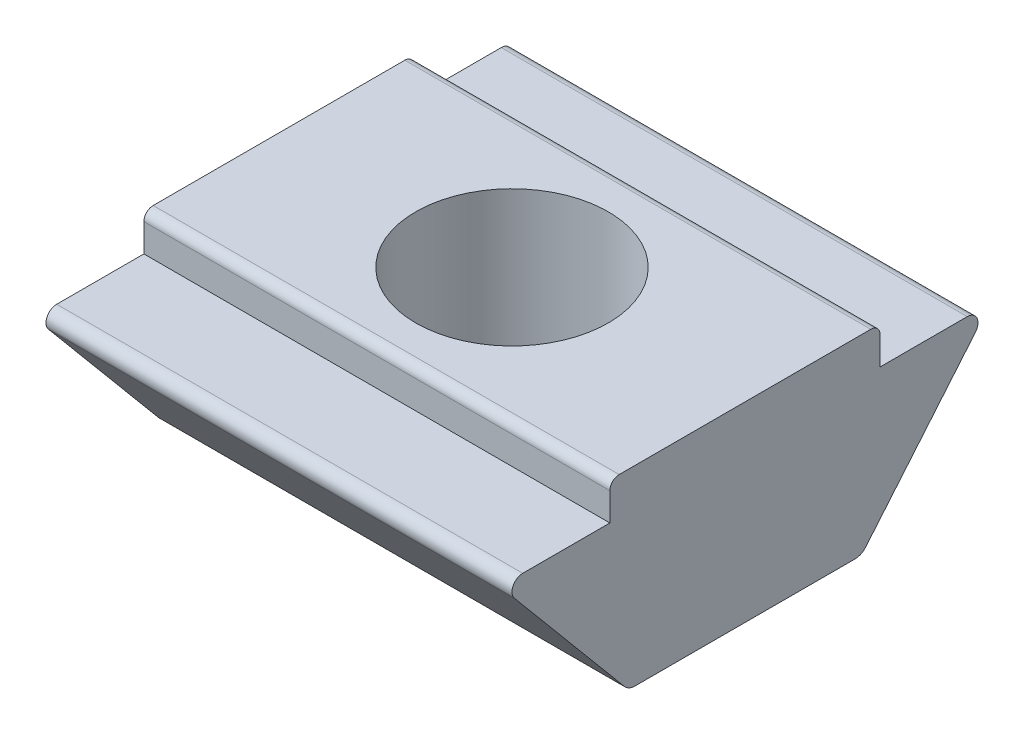
ISO-10303-21;
HEADER;
FILE_DESCRIPTION(('STEP AP214'),'2;1');
FILE_NAME('part.step','',(''),(''),'','','');
FILE_SCHEMA(('AUTOMOTIVE_DESIGN { 1 0 10303 214 1 1 1 1 }'));
ENDSEC;
DATA;
#1=APPLICATION_CONTEXT('core data for automotive mechanical design processes');
#2=APPLICATION_PROTOCOL_DEFINITION('international standard','automotive_design',2000,#1);
#3=PRODUCT_CONTEXT('',#1,'mechanical');
#4=PRODUCT('Part','Part','',(#3));
#5=PRODUCT_RELATED_PRODUCT_CATEGORY('part','',(#4));
#6=PRODUCT_DEFINITION_FORMATION('','',#4);
#7=PRODUCT_DEFINITION_CONTEXT('part definition',#1,'design');
#8=PRODUCT_DEFINITION('design','',#6,#7);
#9=PRODUCT_DEFINITION_SHAPE('','',#8);
#10=(LENGTH_UNIT() NAMED_UNIT(*) SI_UNIT(.MILLI.,.METRE.));
#11=(NAMED_UNIT(*) PLANE_ANGLE_UNIT() SI_UNIT($,.RADIAN.));
#12=(NAMED_UNIT(*) SI_UNIT($,.STERADIAN.) SOLID_ANGLE_UNIT());
#13=UNCERTAINTY_MEASURE_WITH_UNIT(LENGTH_MEASURE(1.E-05),#10,'distance_accuracy_value','');
#14=(GEOMETRIC_REPRESENTATION_CONTEXT(3) GLOBAL_UNCERTAINTY_ASSIGNED_CONTEXT((#13)) GLOBAL_UNIT_ASSIGNED_CONTEXT((#10,
#11,#12)) REPRESENTATION_CONTEXT('',''));
#15=CARTESIAN_POINT('',(0.,0.,0.));
#16=DIRECTION('',(0.,0.,1.));
#17=DIRECTION('',(1.,0.,0.));
#18=AXIS2_PLACEMENT_3D('',#15,#16,#17);
#19=CARTESIAN_POINT('',(5.,-1.17763591617242,-4.94636223024199));
#20=DIRECTION('',(0.,0.641895287706171,0.766792305399977));
#21=DIRECTION('',(0.,-0.766792305399977,0.641895287706171));
#22=AXIS2_PLACEMENT_3D('',#19,#20,#21);
#23=PLANE('',#22);
#24=DIRECTION('',(0.,0.766792305399977,-0.641895287706171));
#25=VECTOR('',#24,1.);
#26=CARTESIAN_POINT('',(5.,-1.17763591617242,-4.94636223024199));
#27=LINE('',#26,#25);
#28=CARTESIAN_POINT('',(5.,-3.99256858631185,-2.58993272064991));
#29=VERTEX_POINT('',#28);
#30=CARTESIAN_POINT('',(5.,-1.17763591617242,-4.94636223024199));
#31=VERTEX_POINT('',#30);
#32=EDGE_CURVE('E140',#29,#31,#27,.T.);
#33=ORIENTED_EDGE('',*,*,#32,.F.);
#34=DIRECTION('',(-1.,0.,0.));
#35=VECTOR('',#34,1.);
#36=CARTESIAN_POINT('',(5.,-3.99256858631185,-2.58993272064991));
#37=LINE('',#36,#35);
#38=CARTESIAN_POINT('',(-5.,-3.99256858631185,-2.58993272064991));
#39=VERTEX_POINT('',#38);
#40=EDGE_CURVE('E185',#29,#39,#37,.T.);
#41=ORIENTED_EDGE('',*,*,#40,.T.);
#42=DIRECTION('',(0.,0.766792305399977,-0.641895287706171));
#43=VECTOR('',#42,1.);
#44=CARTESIAN_POINT('',(-5.,-1.17763591617242,-4.94636223024199));
#45=LINE('',#44,#43);
#46=CARTESIAN_POINT('',(-5.,-1.17763591617242,-4.94636223024199));
#47=VERTEX_POINT('',#46);
#48=EDGE_CURVE('E164',#39,#47,#45,.T.);
#49=ORIENTED_EDGE('',*,*,#48,.T.);
#50=DIRECTION('',(-1.,0.,0.));
#51=VECTOR('',#50,1.);
#52=CARTESIAN_POINT('',(5.,-1.17763591617242,-4.94636223024199));
#53=LINE('',#52,#51);
#54=EDGE_CURVE('E157',#31,#47,#53,.T.);
#55=ORIENTED_EDGE('',*,*,#54,.F.);
#56=EDGE_LOOP('',(#33,#41,#49,#55));
#57=FACE_BOUND('',#56,.T.);
#58=ADVANCED_FACE('F38',(#57),#23,.F.);
#59=CARTESIAN_POINT('',(5.,-1.03,-4.77));
#60=DIRECTION('',(-1.,0.,0.));
#61=DIRECTION('',(0.,0.,1.));
#62=AXIS2_PLACEMENT_3D('',#59,#60,#61);
#63=CYLINDRICAL_SURFACE('',#62,0.229999999999998);
#64=CARTESIAN_POINT('',(-5.,-1.03,-4.77));
#65=DIRECTION('',(1.,0.,0.));
#66=DIRECTION('',(0.,0.,1.));
#67=AXIS2_PLACEMENT_3D('',#64,#65,#66);
#68=CIRCLE('',#67,0.229999999999998);
#69=CARTESIAN_POINT('',(-5.,-0.799999999999998,-4.77));
#70=VERTEX_POINT('',#69);
#71=EDGE_CURVE('E224',#47,#70,#68,.T.);
#72=ORIENTED_EDGE('',*,*,#71,.T.);
#73=DIRECTION('',(-1.,0.,0.));
#74=VECTOR('',#73,1.);
#75=CARTESIAN_POINT('',(5.,-0.799999999999998,-4.77));
#76=LINE('',#75,#74);
#77=CARTESIAN_POINT('',(5.,-0.799999999999998,-4.77));
#78=VERTEX_POINT('',#77);
#79=EDGE_CURVE('E159',#78,#70,#76,.T.);
#80=ORIENTED_EDGE('',*,*,#79,.F.);
#81=CARTESIAN_POINT('',(5.,-1.03,-4.77));
#82=DIRECTION('',(1.,0.,0.));
#83=DIRECTION('',(0.,0.,1.));
#84=AXIS2_PLACEMENT_3D('',#81,#82,#83);
#85=CIRCLE('',#84,0.229999999999998);
#86=EDGE_CURVE('E143',#31,#78,#85,.T.);
#87=ORIENTED_EDGE('',*,*,#86,.F.);
#88=ORIENTED_EDGE('',*,*,#54,.T.);
#89=EDGE_LOOP('',(#72,#80,#87,#88));
#90=FACE_BOUND('',#89,.T.);
#91=ADVANCED_FACE('F156',(#90),#63,.T.);
#92=CARTESIAN_POINT('',(5.,-0.8,-2.9));
#93=DIRECTION('',(0.,-1.,0.));
#94=DIRECTION('',(0.,0.,-1.));
#95=AXIS2_PLACEMENT_3D('',#92,#93,#94);
#96=PLANE('',#95);
#97=DIRECTION('',(0.,0.,1.));
#98=VECTOR('',#97,1.);
#99=CARTESIAN_POINT('',(-5.,-0.8,-2.9));
#100=LINE('',#99,#98);
#101=CARTESIAN_POINT('',(-5.,-0.8,-2.9));
#102=VERTEX_POINT('',#101);
#103=EDGE_CURVE('E220',#70,#102,#100,.T.);
#104=ORIENTED_EDGE('',*,*,#103,.T.);
#105=DIRECTION('',(-1.,0.,0.));
#106=VECTOR('',#105,1.);
#107=CARTESIAN_POINT('',(5.,-0.8,-2.9));
#108=LINE('',#107,#106);
#109=CARTESIAN_POINT('',(5.,-0.8,-2.9));
#110=VERTEX_POINT('',#109);
#111=EDGE_CURVE('E170',#110,#102,#108,.T.);
#112=ORIENTED_EDGE('',*,*,#111,.F.);
#113=DIRECTION('',(0.,0.,1.));
#114=VECTOR('',#113,1.);
#115=CARTESIAN_POINT('',(5.,-0.8,-2.9));
#116=LINE('',#115,#114);
#117=EDGE_CURVE('E161',#78,#110,#116,.T.);
#118=ORIENTED_EDGE('',*,*,#117,.F.);
#119=ORIENTED_EDGE('',*,*,#79,.T.);
#120=EDGE_LOOP('',(#104,#112,#118,#119));
#121=FACE_BOUND('',#120,.T.);
#122=ADVANCED_FACE('F277',(#121),#96,.F.);
#123=CARTESIAN_POINT('',(5.,0.,-2.9));
#124=DIRECTION('',(0.,0.,1.));
#125=DIRECTION('',(1.,0.,0.));
#126=AXIS2_PLACEMENT_3D('',#123,#124,#125);
#127=PLANE('',#126);
#128=DIRECTION('',(0.,1.,0.));
#129=VECTOR('',#128,1.);
#130=CARTESIAN_POINT('',(-5.,0.,-2.9));
#131=LINE('',#130,#129);
#132=CARTESIAN_POINT('',(-5.,-0.2,-2.9));
#133=VERTEX_POINT('',#132);
#134=EDGE_CURVE('E215',#102,#133,#131,.T.);
#135=ORIENTED_EDGE('',*,*,#134,.T.);
#136=DIRECTION('',(-1.,0.,0.));
#137=VECTOR('',#136,1.);
#138=CARTESIAN_POINT('',(5.,-0.2,-2.9));
#139=LINE('',#138,#137);
#140=CARTESIAN_POINT('',(5.,-0.2,-2.9));
#141=VERTEX_POINT('',#140);
#142=EDGE_CURVE('E61',#133,#141,#139,.F.);
#143=ORIENTED_EDGE('',*,*,#142,.T.);
#144=DIRECTION('',(0.,1.,0.));
#145=VECTOR('',#144,1.);
#146=CARTESIAN_POINT('',(5.,0.,-2.9));
#147=LINE('',#146,#145);
#148=EDGE_CURVE('E200',#110,#141,#147,.T.);
#149=ORIENTED_EDGE('',*,*,#148,.F.);
#150=ORIENTED_EDGE('',*,*,#111,.T.);
#151=EDGE_LOOP('',(#135,#143,#149,#150));
#152=FACE_BOUND('',#151,.T.);
#153=ADVANCED_FACE('F218',(#152),#127,.F.);
#154=CARTESIAN_POINT('',(5.,0.,2.9));
#155=DIRECTION('',(0.,-1.,0.));
#156=DIRECTION('',(0.,0.,-1.));
#157=AXIS2_PLACEMENT_3D('',#154,#155,#156);
#158=PLANE('',#157);
#159=CARTESIAN_POINT('',(0.,0.,0.));
#160=DIRECTION('',(0.,1.,0.));
#161=DIRECTION('',(0.,0.,1.));
#162=AXIS2_PLACEMENT_3D('',#159,#160,#161);
#163=CIRCLE('',#162,2.067);
#164=CARTESIAN_POINT('',(0.,0.,2.067));
#165=VERTEX_POINT('',#164);
#166=EDGE_CURVE('E437',#165,#165,#163,.T.);
#167=ORIENTED_EDGE('',*,*,#166,.F.);
#168=EDGE_LOOP('',(#167));
#169=FACE_BOUND('',#168,.T.);
#170=DIRECTION('',(0.,0.,1.));
#171=VECTOR('',#170,1.);
#172=CARTESIAN_POINT('',(5.,0.,2.9));
#173=LINE('',#172,#171);
#174=CARTESIAN_POINT('',(5.,0.,-2.7));
#175=VERTEX_POINT('',#174);
#176=CARTESIAN_POINT('',(5.,0.,2.7));
#177=VERTEX_POINT('',#176);
#178=EDGE_CURVE('E199',#175,#177,#173,.T.);
#179=ORIENTED_EDGE('',*,*,#178,.F.);
#180=DIRECTION('',(-1.,0.,0.));
#181=VECTOR('',#180,1.);
#182=CARTESIAN_POINT('',(5.,0.,-2.7));
#183=LINE('',#182,#181);
#184=CARTESIAN_POINT('',(-5.,0.,-2.7));
#185=VERTEX_POINT('',#184);
#186=EDGE_CURVE('E189',#175,#185,#183,.T.);
#187=ORIENTED_EDGE('',*,*,#186,.T.);
#188=DIRECTION('',(0.,0.,1.));
#189=VECTOR('',#188,1.);
#190=CARTESIAN_POINT('',(-5.,0.,2.9));
#191=LINE('',#190,#189);
#192=CARTESIAN_POINT('',(-5.,0.,2.7));
#193=VERTEX_POINT('',#192);
#194=EDGE_CURVE('E216',#185,#193,#191,.T.);
#195=ORIENTED_EDGE('',*,*,#194,.T.);
#196=DIRECTION('',(-1.,0.,0.));
#197=VECTOR('',#196,1.);
#198=CARTESIAN_POINT('',(5.,0.,2.7));
#199=LINE('',#198,#197);
#200=EDGE_CURVE('E187',#193,#177,#199,.F.);
#201=ORIENTED_EDGE('',*,*,#200,.T.);
#202=EDGE_LOOP('',(#179,#187,#195,#201));
#203=FACE_BOUND('',#202,.T.);
#204=ADVANCED_FACE('F204',(#169,#203),#158,.F.);
#205=CARTESIAN_POINT('',(5.,-0.8,2.9));
#206=DIRECTION('',(0.,0.,-1.));
#207=DIRECTION('',(-1.,0.,0.));
#208=AXIS2_PLACEMENT_3D('',#205,#206,#207);
#209=PLANE('',#208);
#210=DIRECTION('',(0.,-1.,0.));
#211=VECTOR('',#210,1.);
#212=CARTESIAN_POINT('',(5.,-0.8,2.9));
#213=LINE('',#212,#211);
#214=CARTESIAN_POINT('',(5.,-0.2,2.9));
#215=VERTEX_POINT('',#214);
#216=CARTESIAN_POINT('',(5.,-0.8,2.9));
#217=VERTEX_POINT('',#216);
#218=EDGE_CURVE('E208',#215,#217,#213,.T.);
#219=ORIENTED_EDGE('',*,*,#218,.F.);
#220=DIRECTION('',(-1.,0.,0.));
#221=VECTOR('',#220,1.);
#222=CARTESIAN_POINT('',(5.,-0.2,2.9));
#223=LINE('',#222,#221);
#224=CARTESIAN_POINT('',(-5.,-0.2,2.9));
#225=VERTEX_POINT('',#224);
#226=EDGE_CURVE('E11',#215,#225,#223,.T.);
#227=ORIENTED_EDGE('',*,*,#226,.T.);
#228=DIRECTION('',(0.,-1.,0.));
#229=VECTOR('',#228,1.);
#230=CARTESIAN_POINT('',(-5.,-0.8,2.9));
#231=LINE('',#230,#229);
#232=CARTESIAN_POINT('',(-5.,-0.8,2.9));
#233=VERTEX_POINT('',#232);
#234=EDGE_CURVE('E222',#225,#233,#231,.T.);
#235=ORIENTED_EDGE('',*,*,#234,.T.);
#236=DIRECTION('',(-1.,0.,0.));
#237=VECTOR('',#236,1.);
#238=CARTESIAN_POINT('',(5.,-0.8,2.9));
#239=LINE('',#238,#237);
#240=EDGE_CURVE('E245',#217,#233,#239,.T.);
#241=ORIENTED_EDGE('',*,*,#240,.F.);
#242=EDGE_LOOP('',(#219,#227,#235,#241));
#243=FACE_BOUND('',#242,.T.);
#244=ADVANCED_FACE('F282',(#243),#209,.F.);
#245=CARTESIAN_POINT('',(5.,-0.8,4.77));
#246=DIRECTION('',(0.,-1.,0.));
#247=DIRECTION('',(0.,0.,-1.));
#248=AXIS2_PLACEMENT_3D('',#245,#246,#247);
#249=PLANE('',#248);
#250=DIRECTION('',(0.,0.,1.));
#251=VECTOR('',#250,1.);
#252=CARTESIAN_POINT('',(-5.,-0.8,4.77));
#253=LINE('',#252,#251);
#254=CARTESIAN_POINT('',(-5.,-0.800000000000001,4.77));
#255=VERTEX_POINT('',#254);
#256=EDGE_CURVE('E229',#233,#255,#253,.T.);
#257=ORIENTED_EDGE('',*,*,#256,.T.);
#258=DIRECTION('',(-1.,0.,0.));
#259=VECTOR('',#258,1.);
#260=CARTESIAN_POINT('',(5.,-0.800000000000001,4.77));
#261=LINE('',#260,#259);
#262=CARTESIAN_POINT('',(5.,-0.800000000000001,4.77));
#263=VERTEX_POINT('',#262);
#264=EDGE_CURVE('E241',#263,#255,#261,.T.);
#265=ORIENTED_EDGE('',*,*,#264,.F.);
#266=DIRECTION('',(0.,0.,1.));
#267=VECTOR('',#266,1.);
#268=CARTESIAN_POINT('',(5.,-0.8,4.77));
#269=LINE('',#268,#267);
#270=EDGE_CURVE('E253',#217,#263,#269,.T.);
#271=ORIENTED_EDGE('',*,*,#270,.F.);
#272=ORIENTED_EDGE('',*,*,#240,.T.);
#273=EDGE_LOOP('',(#257,#265,#271,#272));
#274=FACE_BOUND('',#273,.T.);
#275=ADVANCED_FACE('F251',(#274),#249,.F.);
#276=CARTESIAN_POINT('',(5.,-1.03,4.77));
#277=DIRECTION('',(-1.,0.,0.));
#278=DIRECTION('',(0.,0.,1.));
#279=AXIS2_PLACEMENT_3D('',#276,#277,#278);
#280=CYLINDRICAL_SURFACE('',#279,0.229999999999999);
#281=CARTESIAN_POINT('',(-5.,-1.03,4.77));
#282=DIRECTION('',(1.,0.,0.));
#283=DIRECTION('',(0.,0.,1.));
#284=AXIS2_PLACEMENT_3D('',#281,#282,#283);
#285=CIRCLE('',#284,0.229999999999999);
#286=CARTESIAN_POINT('',(-5.,-1.17763591617242,4.94636223024199));
#287=VERTEX_POINT('',#286);
#288=EDGE_CURVE('E231',#255,#287,#285,.T.);
#289=ORIENTED_EDGE('',*,*,#288,.T.);
#290=DIRECTION('',(-1.,0.,0.));
#291=VECTOR('',#290,1.);
#292=CARTESIAN_POINT('',(5.,-1.17763591617242,4.94636223024199));
#293=LINE('',#292,#291);
#294=CARTESIAN_POINT('',(5.,-1.17763591617242,4.94636223024199));
#295=VERTEX_POINT('',#294);
#296=EDGE_CURVE('E238',#295,#287,#293,.T.);
#297=ORIENTED_EDGE('',*,*,#296,.F.);
#298=CARTESIAN_POINT('',(5.,-1.03,4.77));
#299=DIRECTION('',(1.,0.,0.));
#300=DIRECTION('',(0.,0.,1.));
#301=AXIS2_PLACEMENT_3D('',#298,#299,#300);
#302=CIRCLE('',#301,0.229999999999999);
#303=EDGE_CURVE('E269',#263,#295,#302,.T.);
#304=ORIENTED_EDGE('',*,*,#303,.F.);
#305=ORIENTED_EDGE('',*,*,#264,.T.);
#306=EDGE_LOOP('',(#289,#297,#304,#305));
#307=FACE_BOUND('',#306,.T.);
#308=ADVANCED_FACE('F260',(#307),#280,.T.);
#309=CARTESIAN_POINT('',(5.,-4.1,2.5));
#310=DIRECTION('',(0.,0.641895287706171,-0.766792305399977));
#311=DIRECTION('',(0.,0.766792305399977,0.641895287706171));
#312=AXIS2_PLACEMENT_3D('',#309,#310,#311);
#313=PLANE('',#312);
#314=DIRECTION('',(0.,-0.766792305399977,-0.641895287706171));
#315=VECTOR('',#314,1.);
#316=CARTESIAN_POINT('',(-5.,-4.1,2.5));
#317=LINE('',#316,#315);
#318=CARTESIAN_POINT('',(-5.,-3.99256858631185,2.58993272064991));
#319=VERTEX_POINT('',#318);
#320=EDGE_CURVE('E233',#287,#319,#317,.T.);
#321=ORIENTED_EDGE('',*,*,#320,.T.);
#322=DIRECTION('',(-1.,0.,0.));
#323=VECTOR('',#322,1.);
#324=CARTESIAN_POINT('',(5.,-3.99256858631185,2.58993272064991));
#325=LINE('',#324,#323);
#326=CARTESIAN_POINT('',(5.,-3.99256858631185,2.58993272064991));
#327=VERTEX_POINT('',#326);
#328=EDGE_CURVE('E180',#319,#327,#325,.F.);
#329=ORIENTED_EDGE('',*,*,#328,.T.);
#330=DIRECTION('',(0.,-0.766792305399977,-0.641895287706171));
#331=VECTOR('',#330,1.);
#332=CARTESIAN_POINT('',(5.,-4.1,2.5));
#333=LINE('',#332,#331);
#334=EDGE_CURVE('E267',#295,#327,#333,.T.);
#335=ORIENTED_EDGE('',*,*,#334,.F.);
#336=ORIENTED_EDGE('',*,*,#296,.T.);
#337=EDGE_LOOP('',(#321,#329,#335,#336));
#338=FACE_BOUND('',#337,.T.);
#339=ADVANCED_FACE('F264',(#338),#313,.F.);
#340=CARTESIAN_POINT('',(5.,-4.1,-2.5));
#341=DIRECTION('',(0.,1.,0.));
#342=DIRECTION('',(0.,0.,1.));
#343=AXIS2_PLACEMENT_3D('',#340,#341,#342);
#344=PLANE('',#343);
#345=CARTESIAN_POINT('',(0.,-4.1,0.));
#346=DIRECTION('',(0.,1.,0.));
#347=DIRECTION('',(0.,0.,1.));
#348=AXIS2_PLACEMENT_3D('',#345,#346,#347);
#349=CIRCLE('',#348,2.067);
#350=CARTESIAN_POINT('',(0.,-4.1,2.067));
#351=VERTEX_POINT('',#350);
#352=EDGE_CURVE('E275',#351,#351,#349,.T.);
#353=ORIENTED_EDGE('',*,*,#352,.T.);
#354=EDGE_LOOP('',(#353));
#355=FACE_BOUND('',#354,.T.);
#356=DIRECTION('',(0.,0.,-1.));
#357=VECTOR('',#356,1.);
#358=CARTESIAN_POINT('',(5.,-4.1,-2.5));
#359=LINE('',#358,#357);
#360=CARTESIAN_POINT('',(5.,-4.1,2.35989502902991));
#361=VERTEX_POINT('',#360);
#362=CARTESIAN_POINT('',(5.,-4.1,-2.35989502902992));
#363=VERTEX_POINT('',#362);
#364=EDGE_CURVE('E242',#361,#363,#359,.T.);
#365=ORIENTED_EDGE('',*,*,#364,.F.);
#366=DIRECTION('',(-1.,0.,0.));
#367=VECTOR('',#366,1.);
#368=CARTESIAN_POINT('',(5.,-4.1,2.35989502902991));
#369=LINE('',#368,#367);
#370=CARTESIAN_POINT('',(-5.,-4.1,2.35989502902991));
#371=VERTEX_POINT('',#370);
#372=EDGE_CURVE('E168',#361,#371,#369,.T.);
#373=ORIENTED_EDGE('',*,*,#372,.T.);
#374=DIRECTION('',(0.,0.,-1.));
#375=VECTOR('',#374,1.);
#376=CARTESIAN_POINT('',(-5.,-4.1,-2.5));
#377=LINE('',#376,#375);
#378=CARTESIAN_POINT('',(-5.,-4.1,-2.35989502902992));
#379=VERTEX_POINT('',#378);
#380=EDGE_CURVE('E152',#371,#379,#377,.T.);
#381=ORIENTED_EDGE('',*,*,#380,.T.);
#382=DIRECTION('',(-1.,0.,0.));
#383=VECTOR('',#382,1.);
#384=CARTESIAN_POINT('',(5.,-4.1,-2.35989502902992));
#385=LINE('',#384,#383);
#386=EDGE_CURVE('E166',#379,#363,#385,.F.);
#387=ORIENTED_EDGE('',*,*,#386,.T.);
#388=EDGE_LOOP('',(#365,#373,#381,#387));
#389=FACE_BOUND('',#388,.T.);
#390=ADVANCED_FACE('F313',(#355,#389),#344,.F.);
#391=CARTESIAN_POINT('',(5.,-1.03,4.77));
#392=DIRECTION('',(-1.,0.,0.));
#393=DIRECTION('',(0.,0.,1.));
#394=AXIS2_PLACEMENT_3D('',#391,#392,#393);
#395=PLANE('',#394);
#396=ORIENTED_EDGE('',*,*,#148,.T.);
#397=CARTESIAN_POINT('',(5.,-0.2,-2.7));
#398=DIRECTION('',(-1.,0.,0.));
#399=DIRECTION('',(0.,0.,1.));
#400=AXIS2_PLACEMENT_3D('',#397,#398,#399);
#401=CIRCLE('',#400,0.2);
#402=EDGE_CURVE('E46',#141,#175,#401,.F.);
#403=ORIENTED_EDGE('',*,*,#402,.T.);
#404=ORIENTED_EDGE('',*,*,#178,.T.);
#405=CARTESIAN_POINT('',(5.,-0.2,2.7));
#406=DIRECTION('',(-1.,0.,0.));
#407=DIRECTION('',(0.,0.,1.));
#408=AXIS2_PLACEMENT_3D('',#405,#406,#407);
#409=CIRCLE('',#408,0.2);
#410=EDGE_CURVE('E53',#177,#215,#409,.F.);
#411=ORIENTED_EDGE('',*,*,#410,.T.);
#412=ORIENTED_EDGE('',*,*,#218,.T.);
#413=ORIENTED_EDGE('',*,*,#270,.T.);
#414=ORIENTED_EDGE('',*,*,#303,.T.);
#415=ORIENTED_EDGE('',*,*,#334,.T.);
#416=CARTESIAN_POINT('',(5.,-3.8,2.35989502902991));
#417=DIRECTION('',(-1.,0.,0.));
#418=DIRECTION('',(0.,0.,1.));
#419=AXIS2_PLACEMENT_3D('',#416,#417,#418);
#420=CIRCLE('',#419,0.3);
#421=EDGE_CURVE('E183',#327,#361,#420,.F.);
#422=ORIENTED_EDGE('',*,*,#421,.T.);
#423=ORIENTED_EDGE('',*,*,#364,.T.);
#424=CARTESIAN_POINT('',(5.,-3.8,-2.35989502902992));
#425=DIRECTION('',(-1.,0.,0.));
#426=DIRECTION('',(0.,0.,1.));
#427=AXIS2_PLACEMENT_3D('',#424,#425,#426);
#428=CIRCLE('',#427,0.3);
#429=EDGE_CURVE('E147',#363,#29,#428,.F.);
#430=ORIENTED_EDGE('',*,*,#429,.T.);
#431=ORIENTED_EDGE('',*,*,#32,.T.);
#432=ORIENTED_EDGE('',*,*,#86,.T.);
#433=ORIENTED_EDGE('',*,*,#117,.T.);
#434=EDGE_LOOP('',(#396,#403,#404,#411,#412,#413,#414,#415,#422,#423,#430,#431,#432,#433));
#435=FACE_BOUND('',#434,.T.);
#436=ADVANCED_FACE('F142',(#435),#395,.F.);
#437=CARTESIAN_POINT('',(-5.,-1.03,4.77));
#438=DIRECTION('',(-1.,0.,0.));
#439=DIRECTION('',(0.,0.,1.));
#440=AXIS2_PLACEMENT_3D('',#437,#438,#439);
#441=PLANE('',#440);
#442=ORIENTED_EDGE('',*,*,#194,.F.);
#443=CARTESIAN_POINT('',(-5.,-0.2,-2.7));
#444=DIRECTION('',(-1.,0.,0.));
#445=DIRECTION('',(0.,0.,1.));
#446=AXIS2_PLACEMENT_3D('',#443,#444,#445);
#447=CIRCLE('',#446,0.2);
#448=EDGE_CURVE('E194',#185,#133,#447,.T.);
#449=ORIENTED_EDGE('',*,*,#448,.T.);
#450=ORIENTED_EDGE('',*,*,#134,.F.);
#451=ORIENTED_EDGE('',*,*,#103,.F.);
#452=ORIENTED_EDGE('',*,*,#71,.F.);
#453=ORIENTED_EDGE('',*,*,#48,.F.);
#454=CARTESIAN_POINT('',(-5.,-3.8,-2.35989502902992));
#455=DIRECTION('',(-1.,0.,0.));
#456=DIRECTION('',(0.,0.,1.));
#457=AXIS2_PLACEMENT_3D('',#454,#455,#456);
#458=CIRCLE('',#457,0.3);
#459=EDGE_CURVE('E176',#39,#379,#458,.T.);
#460=ORIENTED_EDGE('',*,*,#459,.T.);
#461=ORIENTED_EDGE('',*,*,#380,.F.);
#462=CARTESIAN_POINT('',(-5.,-3.8,2.35989502902991));
#463=DIRECTION('',(-1.,0.,0.));
#464=DIRECTION('',(0.,0.,1.));
#465=AXIS2_PLACEMENT_3D('',#462,#463,#464);
#466=CIRCLE('',#465,0.3);
#467=EDGE_CURVE('E178',#371,#319,#466,.T.);
#468=ORIENTED_EDGE('',*,*,#467,.T.);
#469=ORIENTED_EDGE('',*,*,#320,.F.);
#470=ORIENTED_EDGE('',*,*,#288,.F.);
#471=ORIENTED_EDGE('',*,*,#256,.F.);
#472=ORIENTED_EDGE('',*,*,#234,.F.);
#473=CARTESIAN_POINT('',(-5.,-0.2,2.7));
#474=DIRECTION('',(-1.,0.,0.));
#475=DIRECTION('',(0.,0.,1.));
#476=AXIS2_PLACEMENT_3D('',#473,#474,#475);
#477=CIRCLE('',#476,0.2);
#478=EDGE_CURVE('E192',#225,#193,#477,.T.);
#479=ORIENTED_EDGE('',*,*,#478,.T.);
#480=EDGE_LOOP('',(#442,#449,#450,#451,#452,#453,#460,#461,#468,#469,#470,#471,#472,#479));
#481=FACE_BOUND('',#480,.T.);
#482=ADVANCED_FACE('F213',(#481),#441,.T.);
#483=CARTESIAN_POINT('',(5.,-3.8,2.35989502902991));
#484=DIRECTION('',(-1.,0.,0.));
#485=DIRECTION('',(0.,0.,1.));
#486=AXIS2_PLACEMENT_3D('',#483,#484,#485);
#487=CYLINDRICAL_SURFACE('',#486,0.3);
#488=ORIENTED_EDGE('',*,*,#421,.F.);
#489=ORIENTED_EDGE('',*,*,#328,.F.);
#490=ORIENTED_EDGE('',*,*,#467,.F.);
#491=ORIENTED_EDGE('',*,*,#372,.F.);
#492=EDGE_LOOP('',(#488,#489,#490,#491));
#493=FACE_BOUND('',#492,.T.);
#494=ADVANCED_FACE('F301',(#493),#487,.T.);
#495=CARTESIAN_POINT('',(5.,-3.8,-2.35989502902992));
#496=DIRECTION('',(-1.,0.,0.));
#497=DIRECTION('',(0.,0.,1.));
#498=AXIS2_PLACEMENT_3D('',#495,#496,#497);
#499=CYLINDRICAL_SURFACE('',#498,0.3);
#500=ORIENTED_EDGE('',*,*,#429,.F.);
#501=ORIENTED_EDGE('',*,*,#386,.F.);
#502=ORIENTED_EDGE('',*,*,#459,.F.);
#503=ORIENTED_EDGE('',*,*,#40,.F.);
#504=EDGE_LOOP('',(#500,#501,#502,#503));
#505=FACE_BOUND('',#504,.T.);
#506=ADVANCED_FACE('F292',(#505),#499,.T.);
#507=CARTESIAN_POINT('',(5.,-0.2,-2.7));
#508=DIRECTION('',(-1.,0.,0.));
#509=DIRECTION('',(0.,0.,1.));
#510=AXIS2_PLACEMENT_3D('',#507,#508,#509);
#511=CYLINDRICAL_SURFACE('',#510,0.2);
#512=ORIENTED_EDGE('',*,*,#402,.F.);
#513=ORIENTED_EDGE('',*,*,#142,.F.);
#514=ORIENTED_EDGE('',*,*,#448,.F.);
#515=ORIENTED_EDGE('',*,*,#186,.F.);
#516=EDGE_LOOP('',(#512,#513,#514,#515));
#517=FACE_BOUND('',#516,.T.);
#518=ADVANCED_FACE('F210',(#517),#511,.T.);
#519=CARTESIAN_POINT('',(5.,-0.2,2.7));
#520=DIRECTION('',(-1.,0.,0.));
#521=DIRECTION('',(0.,0.,1.));
#522=AXIS2_PLACEMENT_3D('',#519,#520,#521);
#523=CYLINDRICAL_SURFACE('',#522,0.2);
#524=ORIENTED_EDGE('',*,*,#410,.F.);
#525=ORIENTED_EDGE('',*,*,#200,.F.);
#526=ORIENTED_EDGE('',*,*,#478,.F.);
#527=ORIENTED_EDGE('',*,*,#226,.F.);
#528=EDGE_LOOP('',(#524,#525,#526,#527));
#529=FACE_BOUND('',#528,.T.);
#530=ADVANCED_FACE('F40',(#529),#523,.T.);
#531=CARTESIAN_POINT('',(0.,0.,0.));
#532=DIRECTION('',(0.,1.,0.));
#533=DIRECTION('',(0.,0.,1.));
#534=AXIS2_PLACEMENT_3D('',#531,#532,#533);
#535=CYLINDRICAL_SURFACE('',#534,2.067);
#536=ORIENTED_EDGE('',*,*,#352,.F.);
#537=EDGE_LOOP('',(#536));
#538=FACE_BOUND('',#537,.T.);
#539=ORIENTED_EDGE('',*,*,#166,.T.);
#540=EDGE_LOOP('',(#539));
#541=FACE_BOUND('',#540,.T.);
#542=ADVANCED_FACE('F285',(#538,#541),#535,.F.);
#543=CLOSED_SHELL('',(#58,#91,#122,#153,#204,#244,#275,#308,#339,#390,#436,#482,#494,#506,#518,
#530,#542));
#544=MANIFOLD_SOLID_BREP('B2',#543);
#545=ADVANCED_BREP_SHAPE_REPRESENTATION('',(#18,#544),#14);
#546=SHAPE_DEFINITION_REPRESENTATION(#9,#545);
ENDSEC;
END-ISO-10303-21;
